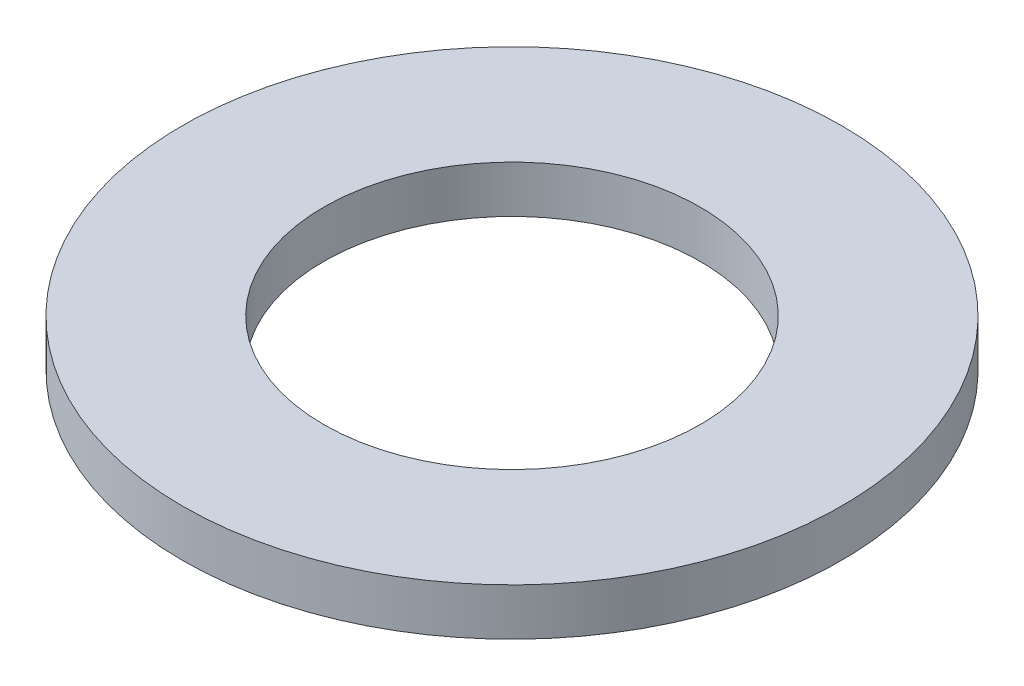
ISO-10303-21;
HEADER;
FILE_DESCRIPTION(('STEP AP214'),'2;1');
FILE_NAME('part.step','',(''),(''),'','','');
FILE_SCHEMA(('AUTOMOTIVE_DESIGN { 1 0 10303 214 1 1 1 1 }'));
ENDSEC;
DATA;
#1=APPLICATION_CONTEXT('core data for automotive mechanical design processes');
#2=APPLICATION_PROTOCOL_DEFINITION('international standard','automotive_design',2000,#1);
#3=PRODUCT_CONTEXT('',#1,'mechanical');
#4=PRODUCT('Part','Part','',(#3));
#5=PRODUCT_RELATED_PRODUCT_CATEGORY('part','',(#4));
#6=PRODUCT_DEFINITION_FORMATION('','',#4);
#7=PRODUCT_DEFINITION_CONTEXT('part definition',#1,'design');
#8=PRODUCT_DEFINITION('design','',#6,#7);
#9=PRODUCT_DEFINITION_SHAPE('','',#8);
#10=(LENGTH_UNIT() NAMED_UNIT(*) SI_UNIT(.MILLI.,.METRE.));
#11=(NAMED_UNIT(*) PLANE_ANGLE_UNIT() SI_UNIT($,.RADIAN.));
#12=(NAMED_UNIT(*) SI_UNIT($,.STERADIAN.) SOLID_ANGLE_UNIT());
#13=UNCERTAINTY_MEASURE_WITH_UNIT(LENGTH_MEASURE(1.E-05),#10,'distance_accuracy_value','');
#14=(GEOMETRIC_REPRESENTATION_CONTEXT(3) GLOBAL_UNCERTAINTY_ASSIGNED_CONTEXT((#13)) GLOBAL_UNIT_ASSIGNED_CONTEXT((#10,
#11,#12)) REPRESENTATION_CONTEXT('',''));
#15=CARTESIAN_POINT('',(0.,0.,0.));
#16=DIRECTION('',(0.,0.,1.));
#17=DIRECTION('',(1.,0.,0.));
#18=AXIS2_PLACEMENT_3D('',#15,#16,#17);
#19=CARTESIAN_POINT('',(0.,1.5875,0.));
#20=DIRECTION('',(0.,1.,0.));
#21=DIRECTION('',(0.,0.,1.));
#22=AXIS2_PLACEMENT_3D('',#19,#20,#21);
#23=PLANE('',#22);
#24=CARTESIAN_POINT('',(0.,1.5875,0.));
#25=DIRECTION('',(0.,1.,0.));
#26=DIRECTION('',(0.,0.,1.));
#27=AXIS2_PLACEMENT_3D('',#24,#25,#26);
#28=CIRCLE('',#27,11.1125);
#29=CARTESIAN_POINT('',(0.,1.5875,11.1125));
#30=VERTEX_POINT('',#29);
#31=EDGE_CURVE('E10',#30,#30,#28,.T.);
#32=ORIENTED_EDGE('',*,*,#31,.T.);
#33=EDGE_LOOP('',(#32));
#34=FACE_BOUND('',#33,.T.);
#35=CARTESIAN_POINT('',(0.,1.5875,0.));
#36=DIRECTION('',(0.,1.,0.));
#37=DIRECTION('',(0.,0.,1.));
#38=AXIS2_PLACEMENT_3D('',#35,#36,#37);
#39=CIRCLE('',#38,6.35);
#40=CARTESIAN_POINT('',(0.,1.5875,6.35));
#41=VERTEX_POINT('',#40);
#42=EDGE_CURVE('E42',#41,#41,#39,.T.);
#43=ORIENTED_EDGE('',*,*,#42,.F.);
#44=EDGE_LOOP('',(#43));
#45=FACE_BOUND('',#44,.T.);
#46=ADVANCED_FACE('F31',(#34,#45),#23,.T.);
#47=CARTESIAN_POINT('',(0.,0.,0.));
#48=DIRECTION('',(0.,1.,0.));
#49=DIRECTION('',(0.,0.,1.));
#50=AXIS2_PLACEMENT_3D('',#47,#48,#49);
#51=PLANE('',#50);
#52=CARTESIAN_POINT('',(0.,0.,0.));
#53=DIRECTION('',(0.,1.,0.));
#54=DIRECTION('',(0.,0.,1.));
#55=AXIS2_PLACEMENT_3D('',#52,#53,#54);
#56=CIRCLE('',#55,11.1125);
#57=CARTESIAN_POINT('',(0.,0.,11.1125));
#58=VERTEX_POINT('',#57);
#59=EDGE_CURVE('E35',#58,#58,#56,.T.);
#60=ORIENTED_EDGE('',*,*,#59,.F.);
#61=EDGE_LOOP('',(#60));
#62=FACE_BOUND('',#61,.T.);
#63=CARTESIAN_POINT('',(0.,0.,0.));
#64=DIRECTION('',(0.,1.,0.));
#65=DIRECTION('',(0.,0.,1.));
#66=AXIS2_PLACEMENT_3D('',#63,#64,#65);
#67=CIRCLE('',#66,6.35);
#68=CARTESIAN_POINT('',(0.,0.,6.35));
#69=VERTEX_POINT('',#68);
#70=EDGE_CURVE('E44',#69,#69,#67,.T.);
#71=ORIENTED_EDGE('',*,*,#70,.T.);
#72=EDGE_LOOP('',(#71));
#73=FACE_BOUND('',#72,.T.);
#74=ADVANCED_FACE('F54',(#62,#73),#51,.F.);
#75=CARTESIAN_POINT('',(0.,1.5875,0.));
#76=DIRECTION('',(0.,-1.,0.));
#77=DIRECTION('',(0.,0.,-1.));
#78=AXIS2_PLACEMENT_3D('',#75,#76,#77);
#79=CYLINDRICAL_SURFACE('',#78,11.1125);
#80=ORIENTED_EDGE('',*,*,#31,.F.);
#81=EDGE_LOOP('',(#80));
#82=FACE_BOUND('',#81,.T.);
#83=ORIENTED_EDGE('',*,*,#59,.T.);
#84=EDGE_LOOP('',(#83));
#85=FACE_BOUND('',#84,.T.);
#86=ADVANCED_FACE('F33',(#82,#85),#79,.T.);
#87=CARTESIAN_POINT('',(0.,1.5875,0.));
#88=DIRECTION('',(0.,-1.,0.));
#89=DIRECTION('',(0.,0.,-1.));
#90=AXIS2_PLACEMENT_3D('',#87,#88,#89);
#91=CYLINDRICAL_SURFACE('',#90,6.35);
#92=ORIENTED_EDGE('',*,*,#42,.T.);
#93=EDGE_LOOP('',(#92));
#94=FACE_BOUND('',#93,.T.);
#95=ORIENTED_EDGE('',*,*,#70,.F.);
#96=EDGE_LOOP('',(#95));
#97=FACE_BOUND('',#96,.T.);
#98=ADVANCED_FACE('F50',(#94,#97),#91,.F.);
#99=CLOSED_SHELL('',(#46,#74,#86,#98));
#100=MANIFOLD_SOLID_BREP('B2',#99);
#101=ADVANCED_BREP_SHAPE_REPRESENTATION('',(#18,#100),#14);
#102=SHAPE_DEFINITION_REPRESENTATION(#9,#101);
ENDSEC;
END-ISO-10303-21;
